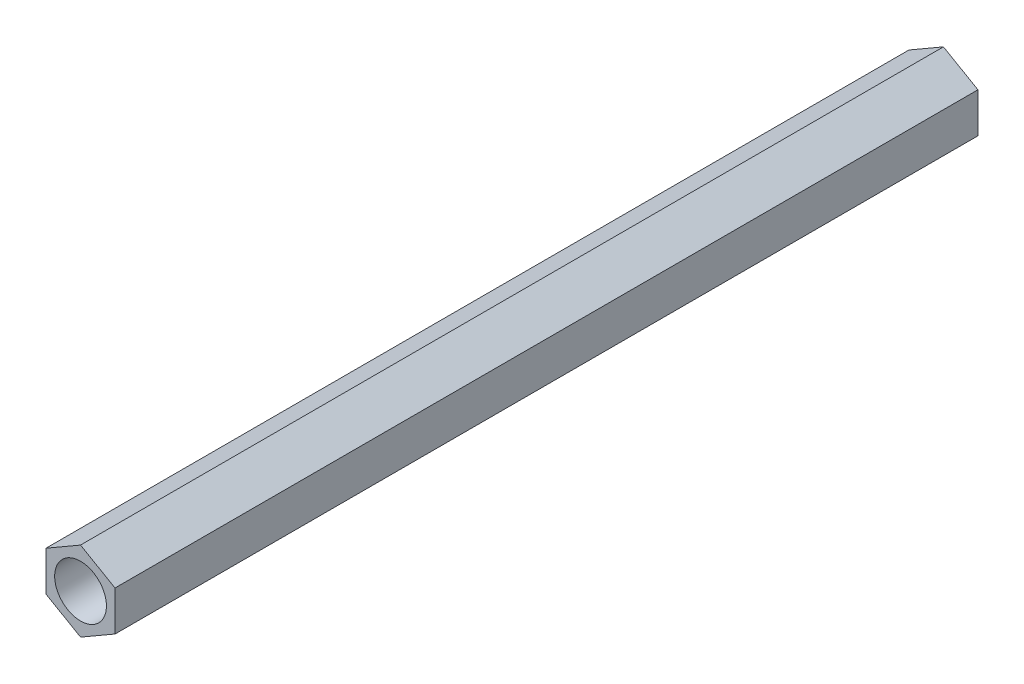
ISO-10303-21;
HEADER;
FILE_DESCRIPTION(('STEP AP214'),'2;1');
FILE_NAME('part.step','',(''),(''),'','','');
FILE_SCHEMA(('AUTOMOTIVE_DESIGN { 1 0 10303 214 1 1 1 1 }'));
ENDSEC;
DATA;
#1=APPLICATION_CONTEXT('core data for automotive mechanical design processes');
#2=APPLICATION_PROTOCOL_DEFINITION('international standard','automotive_design',2000,#1);
#3=PRODUCT_CONTEXT('',#1,'mechanical');
#4=PRODUCT('Part','Part','',(#3));
#5=PRODUCT_RELATED_PRODUCT_CATEGORY('part','',(#4));
#6=PRODUCT_DEFINITION_FORMATION('','',#4);
#7=PRODUCT_DEFINITION_CONTEXT('part definition',#1,'design');
#8=PRODUCT_DEFINITION('design','',#6,#7);
#9=PRODUCT_DEFINITION_SHAPE('','',#8);
#10=(LENGTH_UNIT() NAMED_UNIT(*) SI_UNIT(.MILLI.,.METRE.));
#11=(NAMED_UNIT(*) PLANE_ANGLE_UNIT() SI_UNIT($,.RADIAN.));
#12=(NAMED_UNIT(*) SI_UNIT($,.STERADIAN.) SOLID_ANGLE_UNIT());
#13=UNCERTAINTY_MEASURE_WITH_UNIT(LENGTH_MEASURE(1.E-05),#10,'distance_accuracy_value','');
#14=(GEOMETRIC_REPRESENTATION_CONTEXT(3) GLOBAL_UNCERTAINTY_ASSIGNED_CONTEXT((#13)) GLOBAL_UNIT_ASSIGNED_CONTEXT((#10,
#11,#12)) REPRESENTATION_CONTEXT('',''));
#15=CARTESIAN_POINT('',(0.,0.,0.));
#16=DIRECTION('',(0.,0.,1.));
#17=DIRECTION('',(1.,0.,0.));
#18=AXIS2_PLACEMENT_3D('',#15,#16,#17);
#19=CARTESIAN_POINT('',(0.,0.,50.));
#20=DIRECTION('',(0.,0.,1.));
#21=DIRECTION('',(1.,0.,0.));
#22=AXIS2_PLACEMENT_3D('',#19,#20,#21);
#23=PLANE('',#22);
#24=DIRECTION('',(0.865510233957249,0.500891240605451,0.));
#25=VECTOR('',#24,1.);
#26=CARTESIAN_POINT('',(0.00237734808771496,-2.30939985311106,50.));
#27=LINE('',#26,#25);
#28=CARTESIAN_POINT('',(0.00237734808771496,-2.30939985311106,50.));
#29=VERTEX_POINT('',#28);
#30=CARTESIAN_POINT('',(2.00118761433409,-1.15264108271793,50.));
#31=VERTEX_POINT('',#30);
#32=EDGE_CURVE('E146',#29,#31,#27,.T.);
#33=ORIENTED_EDGE('',*,*,#32,.T.);
#34=DIRECTION('',(-0.00102942191879974,0.999999470145116,0.));
#35=VECTOR('',#34,1.);
#36=CARTESIAN_POINT('',(2.00118761433409,-1.15264108271793,50.));
#37=LINE('',#36,#35);
#38=CARTESIAN_POINT('',(1.99881026624637,1.15675877039313,50.));
#39=VERTEX_POINT('',#38);
#40=EDGE_CURVE('E94',#31,#39,#37,.T.);
#41=ORIENTED_EDGE('',*,*,#40,.T.);
#42=DIRECTION('',(-0.866539655876049,0.499108229539665,0.));
#43=VECTOR('',#42,1.);
#44=CARTESIAN_POINT('',(1.99881026624637,1.15675877039313,50.));
#45=LINE('',#44,#43);
#46=CARTESIAN_POINT('',(-0.00237734808771488,2.30939985311106,50.));
#47=VERTEX_POINT('',#46);
#48=EDGE_CURVE('E107',#39,#47,#45,.T.);
#49=ORIENTED_EDGE('',*,*,#48,.T.);
#50=DIRECTION('',(-0.865510233957249,-0.500891240605451,0.));
#51=VECTOR('',#50,1.);
#52=CARTESIAN_POINT('',(-0.00237734808771488,2.30939985311106,50.));
#53=LINE('',#52,#51);
#54=CARTESIAN_POINT('',(-2.00118761433409,1.15264108271793,50.));
#55=VERTEX_POINT('',#54);
#56=EDGE_CURVE('E101',#47,#55,#53,.T.);
#57=ORIENTED_EDGE('',*,*,#56,.T.);
#58=DIRECTION('',(0.00102942191879993,-0.999999470145116,0.));
#59=VECTOR('',#58,1.);
#60=CARTESIAN_POINT('',(-2.00118761433409,1.15264108271793,50.));
#61=LINE('',#60,#59);
#62=CARTESIAN_POINT('',(-1.99881026624637,-1.15675877039313,50.));
#63=VERTEX_POINT('',#62);
#64=EDGE_CURVE('E105',#55,#63,#61,.T.);
#65=ORIENTED_EDGE('',*,*,#64,.T.);
#66=DIRECTION('',(0.866539655876049,-0.499108229539665,0.));
#67=VECTOR('',#66,1.);
#68=CARTESIAN_POINT('',(-1.99881026624637,-1.15675877039313,50.));
#69=LINE('',#68,#67);
#70=EDGE_CURVE('E57',#63,#29,#69,.T.);
#71=ORIENTED_EDGE('',*,*,#70,.T.);
#72=EDGE_LOOP('',(#33,#41,#49,#57,#65,#71));
#73=FACE_BOUND('',#72,.T.);
#74=CARTESIAN_POINT('',(0.,0.,50.));
#75=DIRECTION('',(0.,0.,1.));
#76=DIRECTION('',(1.,0.,0.));
#77=AXIS2_PLACEMENT_3D('',#74,#75,#76);
#78=CIRCLE('',#77,1.5);
#79=CARTESIAN_POINT('',(1.5,0.,50.));
#80=VERTEX_POINT('',#79);
#81=EDGE_CURVE('E134',#80,#80,#78,.T.);
#82=ORIENTED_EDGE('',*,*,#81,.F.);
#83=EDGE_LOOP('',(#82));
#84=FACE_BOUND('',#83,.T.);
#85=ADVANCED_FACE('F39',(#73,#84),#23,.T.);
#86=CARTESIAN_POINT('',(0.,0.,0.));
#87=DIRECTION('',(0.,0.,1.));
#88=DIRECTION('',(1.,0.,0.));
#89=AXIS2_PLACEMENT_3D('',#86,#87,#88);
#90=PLANE('',#89);
#91=DIRECTION('',(0.865510233957249,0.500891240605451,0.));
#92=VECTOR('',#91,1.);
#93=CARTESIAN_POINT('',(0.00237734808771496,-2.30939985311106,0.));
#94=LINE('',#93,#92);
#95=CARTESIAN_POINT('',(0.00237734808771496,-2.30939985311106,0.));
#96=VERTEX_POINT('',#95);
#97=CARTESIAN_POINT('',(2.00118761433409,-1.15264108271793,0.));
#98=VERTEX_POINT('',#97);
#99=EDGE_CURVE('E129',#96,#98,#94,.T.);
#100=ORIENTED_EDGE('',*,*,#99,.F.);
#101=DIRECTION('',(0.866539655876049,-0.499108229539665,0.));
#102=VECTOR('',#101,1.);
#103=CARTESIAN_POINT('',(-1.99881026624637,-1.15675877039313,0.));
#104=LINE('',#103,#102);
#105=CARTESIAN_POINT('',(-1.99881026624637,-1.15675877039313,0.));
#106=VERTEX_POINT('',#105);
#107=EDGE_CURVE('E86',#106,#96,#104,.T.);
#108=ORIENTED_EDGE('',*,*,#107,.F.);
#109=DIRECTION('',(0.00102942191879993,-0.999999470145116,0.));
#110=VECTOR('',#109,1.);
#111=CARTESIAN_POINT('',(-2.00118761433409,1.15264108271793,0.));
#112=LINE('',#111,#110);
#113=CARTESIAN_POINT('',(-2.00118761433409,1.15264108271793,0.));
#114=VERTEX_POINT('',#113);
#115=EDGE_CURVE('E80',#114,#106,#112,.T.);
#116=ORIENTED_EDGE('',*,*,#115,.F.);
#117=DIRECTION('',(-0.865510233957249,-0.500891240605451,0.));
#118=VECTOR('',#117,1.);
#119=CARTESIAN_POINT('',(-0.00237734808771488,2.30939985311106,0.));
#120=LINE('',#119,#118);
#121=CARTESIAN_POINT('',(-0.00237734808771488,2.30939985311106,0.));
#122=VERTEX_POINT('',#121);
#123=EDGE_CURVE('E116',#122,#114,#120,.T.);
#124=ORIENTED_EDGE('',*,*,#123,.F.);
#125=DIRECTION('',(-0.866539655876049,0.499108229539665,0.));
#126=VECTOR('',#125,1.);
#127=CARTESIAN_POINT('',(1.99881026624637,1.15675877039313,0.));
#128=LINE('',#127,#126);
#129=CARTESIAN_POINT('',(1.99881026624637,1.15675877039313,0.));
#130=VERTEX_POINT('',#129);
#131=EDGE_CURVE('E137',#130,#122,#128,.T.);
#132=ORIENTED_EDGE('',*,*,#131,.F.);
#133=DIRECTION('',(-0.00102942191879974,0.999999470145116,0.));
#134=VECTOR('',#133,1.);
#135=CARTESIAN_POINT('',(2.00118761433409,-1.15264108271793,0.));
#136=LINE('',#135,#134);
#137=EDGE_CURVE('E133',#98,#130,#136,.T.);
#138=ORIENTED_EDGE('',*,*,#137,.F.);
#139=EDGE_LOOP('',(#100,#108,#116,#124,#132,#138));
#140=FACE_BOUND('',#139,.T.);
#141=CARTESIAN_POINT('',(0.,0.,0.));
#142=DIRECTION('',(0.,0.,1.));
#143=DIRECTION('',(1.,0.,0.));
#144=AXIS2_PLACEMENT_3D('',#141,#142,#143);
#145=CIRCLE('',#144,1.5);
#146=CARTESIAN_POINT('',(1.5,0.,0.));
#147=VERTEX_POINT('',#146);
#148=EDGE_CURVE('E243',#147,#147,#145,.T.);
#149=ORIENTED_EDGE('',*,*,#148,.T.);
#150=EDGE_LOOP('',(#149));
#151=FACE_BOUND('',#150,.T.);
#152=ADVANCED_FACE('F159',(#140,#151),#90,.F.);
#153=CARTESIAN_POINT('',(0.00237734808771496,-2.30939985311106,50.));
#154=DIRECTION('',(-0.500891240605451,0.865510233957249,0.));
#155=DIRECTION('',(-0.865510233957249,-0.500891240605451,0.));
#156=AXIS2_PLACEMENT_3D('',#153,#154,#155);
#157=PLANE('',#156);
#158=ORIENTED_EDGE('',*,*,#99,.T.);
#159=DIRECTION('',(0.,0.,-1.));
#160=VECTOR('',#159,1.);
#161=CARTESIAN_POINT('',(2.00118761433409,-1.15264108271793,50.));
#162=LINE('',#161,#160);
#163=EDGE_CURVE('E11',#31,#98,#162,.T.);
#164=ORIENTED_EDGE('',*,*,#163,.F.);
#165=ORIENTED_EDGE('',*,*,#32,.F.);
#166=DIRECTION('',(0.,0.,-1.));
#167=VECTOR('',#166,1.);
#168=CARTESIAN_POINT('',(0.00237734808771496,-2.30939985311106,50.));
#169=LINE('',#168,#167);
#170=EDGE_CURVE('E125',#29,#96,#169,.T.);
#171=ORIENTED_EDGE('',*,*,#170,.T.);
#172=EDGE_LOOP('',(#158,#164,#165,#171));
#173=FACE_BOUND('',#172,.T.);
#174=ADVANCED_FACE('F41',(#173),#157,.F.);
#175=CARTESIAN_POINT('',(2.00118761433409,-1.15264108271793,50.));
#176=DIRECTION('',(-0.999999470145116,-0.00102942191879974,0.));
#177=DIRECTION('',(0.00102942191879974,-0.999999470145116,0.));
#178=AXIS2_PLACEMENT_3D('',#175,#176,#177);
#179=PLANE('',#178);
#180=ORIENTED_EDGE('',*,*,#137,.T.);
#181=DIRECTION('',(0.,0.,-1.));
#182=VECTOR('',#181,1.);
#183=CARTESIAN_POINT('',(1.99881026624637,1.15675877039313,50.));
#184=LINE('',#183,#182);
#185=EDGE_CURVE('E49',#39,#130,#184,.T.);
#186=ORIENTED_EDGE('',*,*,#185,.F.);
#187=ORIENTED_EDGE('',*,*,#40,.F.);
#188=ORIENTED_EDGE('',*,*,#163,.T.);
#189=EDGE_LOOP('',(#180,#186,#187,#188));
#190=FACE_BOUND('',#189,.T.);
#191=ADVANCED_FACE('F184',(#190),#179,.F.);
#192=CARTESIAN_POINT('',(1.99881026624637,1.15675877039313,50.));
#193=DIRECTION('',(-0.499108229539665,-0.866539655876049,0.));
#194=DIRECTION('',(0.866539655876049,-0.499108229539665,0.));
#195=AXIS2_PLACEMENT_3D('',#192,#193,#194);
#196=PLANE('',#195);
#197=ORIENTED_EDGE('',*,*,#131,.T.);
#198=DIRECTION('',(0.,0.,-1.));
#199=VECTOR('',#198,1.);
#200=CARTESIAN_POINT('',(-0.00237734808771488,2.30939985311106,50.));
#201=LINE('',#200,#199);
#202=EDGE_CURVE('E118',#47,#122,#201,.T.);
#203=ORIENTED_EDGE('',*,*,#202,.F.);
#204=ORIENTED_EDGE('',*,*,#48,.F.);
#205=ORIENTED_EDGE('',*,*,#185,.T.);
#206=EDGE_LOOP('',(#197,#203,#204,#205));
#207=FACE_BOUND('',#206,.T.);
#208=ADVANCED_FACE('F156',(#207),#196,.F.);
#209=CARTESIAN_POINT('',(-0.00237734808771488,2.30939985311106,50.));
#210=DIRECTION('',(0.500891240605451,-0.865510233957249,0.));
#211=DIRECTION('',(0.865510233957249,0.500891240605451,0.));
#212=AXIS2_PLACEMENT_3D('',#209,#210,#211);
#213=PLANE('',#212);
#214=ORIENTED_EDGE('',*,*,#123,.T.);
#215=DIRECTION('',(0.,0.,-1.));
#216=VECTOR('',#215,1.);
#217=CARTESIAN_POINT('',(-2.00118761433409,1.15264108271793,50.));
#218=LINE('',#217,#216);
#219=EDGE_CURVE('E113',#55,#114,#218,.T.);
#220=ORIENTED_EDGE('',*,*,#219,.F.);
#221=ORIENTED_EDGE('',*,*,#56,.F.);
#222=ORIENTED_EDGE('',*,*,#202,.T.);
#223=EDGE_LOOP('',(#214,#220,#221,#222));
#224=FACE_BOUND('',#223,.T.);
#225=ADVANCED_FACE('F114',(#224),#213,.F.);
#226=CARTESIAN_POINT('',(-2.00118761433409,1.15264108271793,50.));
#227=DIRECTION('',(0.999999470145116,0.00102942191879993,0.));
#228=DIRECTION('',(-0.00102942191879993,0.999999470145116,0.));
#229=AXIS2_PLACEMENT_3D('',#226,#227,#228);
#230=PLANE('',#229);
#231=ORIENTED_EDGE('',*,*,#115,.T.);
#232=DIRECTION('',(0.,0.,-1.));
#233=VECTOR('',#232,1.);
#234=CARTESIAN_POINT('',(-1.99881026624637,-1.15675877039313,50.));
#235=LINE('',#234,#233);
#236=EDGE_CURVE('E119',#63,#106,#235,.T.);
#237=ORIENTED_EDGE('',*,*,#236,.F.);
#238=ORIENTED_EDGE('',*,*,#64,.F.);
#239=ORIENTED_EDGE('',*,*,#219,.T.);
#240=EDGE_LOOP('',(#231,#237,#238,#239));
#241=FACE_BOUND('',#240,.T.);
#242=ADVANCED_FACE('F121',(#241),#230,.F.);
#243=CARTESIAN_POINT('',(-1.99881026624637,-1.15675877039313,50.));
#244=DIRECTION('',(0.499108229539665,0.866539655876049,0.));
#245=DIRECTION('',(-0.866539655876049,0.499108229539665,0.));
#246=AXIS2_PLACEMENT_3D('',#243,#244,#245);
#247=PLANE('',#246);
#248=ORIENTED_EDGE('',*,*,#107,.T.);
#249=ORIENTED_EDGE('',*,*,#170,.F.);
#250=ORIENTED_EDGE('',*,*,#70,.F.);
#251=ORIENTED_EDGE('',*,*,#236,.T.);
#252=EDGE_LOOP('',(#248,#249,#250,#251));
#253=FACE_BOUND('',#252,.T.);
#254=ADVANCED_FACE('F164',(#253),#247,.F.);
#255=CARTESIAN_POINT('',(0.,0.,50.));
#256=DIRECTION('',(0.,0.,-1.));
#257=DIRECTION('',(-1.,0.,0.));
#258=AXIS2_PLACEMENT_3D('',#255,#256,#257);
#259=CYLINDRICAL_SURFACE('',#258,1.5);
#260=ORIENTED_EDGE('',*,*,#81,.T.);
#261=EDGE_LOOP('',(#260));
#262=FACE_BOUND('',#261,.T.);
#263=ORIENTED_EDGE('',*,*,#148,.F.);
#264=EDGE_LOOP('',(#263));
#265=FACE_BOUND('',#264,.T.);
#266=ADVANCED_FACE('F166',(#262,#265),#259,.F.);
#267=CLOSED_SHELL('',(#85,#152,#174,#191,#208,#225,#242,#254,#266));
#268=MANIFOLD_SOLID_BREP('B2',#267);
#269=ADVANCED_BREP_SHAPE_REPRESENTATION('',(#18,#268),#14);
#270=SHAPE_DEFINITION_REPRESENTATION(#9,#269);
ENDSEC;
END-ISO-10303-21;
